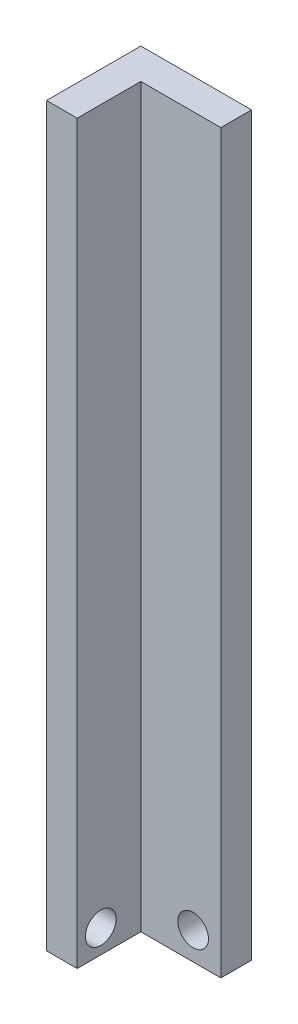
ISO-10303-21;
HEADER;
FILE_DESCRIPTION(('STEP AP214'),'2;1');
FILE_NAME('part.step','',(''),(''),'','','');
FILE_SCHEMA(('AUTOMOTIVE_DESIGN { 1 0 10303 214 1 1 1 1 }'));
ENDSEC;
DATA;
#1=APPLICATION_CONTEXT('core data for automotive mechanical design processes');
#2=APPLICATION_PROTOCOL_DEFINITION('international standard','automotive_design',2000,#1);
#3=PRODUCT_CONTEXT('',#1,'mechanical');
#4=PRODUCT('Part','Part','',(#3));
#5=PRODUCT_RELATED_PRODUCT_CATEGORY('part','',(#4));
#6=PRODUCT_DEFINITION_FORMATION('','',#4);
#7=PRODUCT_DEFINITION_CONTEXT('part definition',#1,'design');
#8=PRODUCT_DEFINITION('design','',#6,#7);
#9=PRODUCT_DEFINITION_SHAPE('','',#8);
#10=(LENGTH_UNIT() NAMED_UNIT(*) SI_UNIT(.MILLI.,.METRE.));
#11=(NAMED_UNIT(*) PLANE_ANGLE_UNIT() SI_UNIT($,.RADIAN.));
#12=(NAMED_UNIT(*) SI_UNIT($,.STERADIAN.) SOLID_ANGLE_UNIT());
#13=UNCERTAINTY_MEASURE_WITH_UNIT(LENGTH_MEASURE(1.E-05),#10,'distance_accuracy_value','');
#14=(GEOMETRIC_REPRESENTATION_CONTEXT(3) GLOBAL_UNCERTAINTY_ASSIGNED_CONTEXT((#13)) GLOBAL_UNIT_ASSIGNED_CONTEXT((#10,
#11,#12)) REPRESENTATION_CONTEXT('',''));
#15=CARTESIAN_POINT('',(0.,0.,0.));
#16=DIRECTION('',(0.,0.,1.));
#17=DIRECTION('',(1.,0.,0.));
#18=AXIS2_PLACEMENT_3D('',#15,#16,#17);
#19=CARTESIAN_POINT('',(-30.3425343753555,304.8,0.));
#20=DIRECTION('',(1.,0.,0.));
#21=DIRECTION('',(0.,0.,-1.));
#22=AXIS2_PLACEMENT_3D('',#19,#20,#21);
#23=PLANE('',#22);
#24=DIRECTION('',(0.,0.,1.));
#25=VECTOR('',#24,1.);
#26=CARTESIAN_POINT('',(-30.3425343753555,0.,0.));
#27=LINE('',#26,#25);
#28=CARTESIAN_POINT('',(-30.3425343753555,0.,-83.1160253016663));
#29=VERTEX_POINT('',#28);
#30=CARTESIAN_POINT('',(-30.3425343753555,0.,-70.4160253016663));
#31=VERTEX_POINT('',#30);
#32=EDGE_CURVE('E127',#29,#31,#27,.T.);
#33=ORIENTED_EDGE('',*,*,#32,.F.);
#34=DIRECTION('',(0.,-1.,0.));
#35=VECTOR('',#34,1.);
#36=CARTESIAN_POINT('',(-30.3425343753555,304.8,-83.1160253016663));
#37=LINE('',#36,#35);
#38=CARTESIAN_POINT('',(-30.3425343753555,304.8,-83.1160253016663));
#39=VERTEX_POINT('',#38);
#40=EDGE_CURVE('E13',#39,#29,#37,.T.);
#41=ORIENTED_EDGE('',*,*,#40,.F.);
#42=DIRECTION('',(0.,0.,1.));
#43=VECTOR('',#42,1.);
#44=CARTESIAN_POINT('',(-30.3425343753555,304.8,0.));
#45=LINE('',#44,#43);
#46=CARTESIAN_POINT('',(-30.3425343753555,304.8,-70.4160253016663));
#47=VERTEX_POINT('',#46);
#48=EDGE_CURVE('E139',#39,#47,#45,.T.);
#49=ORIENTED_EDGE('',*,*,#48,.T.);
#50=DIRECTION('',(0.,-1.,0.));
#51=VECTOR('',#50,1.);
#52=CARTESIAN_POINT('',(-30.3425343753555,304.8,-70.4160253016663));
#53=LINE('',#52,#51);
#54=EDGE_CURVE('E91',#47,#31,#53,.T.);
#55=ORIENTED_EDGE('',*,*,#54,.T.);
#56=EDGE_LOOP('',(#33,#41,#49,#55));
#57=FACE_BOUND('',#56,.T.);
#58=ADVANCED_FACE('F46',(#57),#23,.T.);
#59=CARTESIAN_POINT('',(0.,304.8,-83.1160253016663));
#60=DIRECTION('',(0.,0.,1.));
#61=DIRECTION('',(1.,0.,0.));
#62=AXIS2_PLACEMENT_3D('',#59,#60,#61);
#63=PLANE('',#62);
#64=CARTESIAN_POINT('',(-41.7927710231797,11.4502366478242,-83.1160253016663));
#65=DIRECTION('',(0.,0.,-1.));
#66=DIRECTION('',(-1.,0.,0.));
#67=AXIS2_PLACEMENT_3D('',#64,#65,#66);
#68=CIRCLE('',#67,6.35);
#69=CARTESIAN_POINT('',(-48.1427710231797,11.4502366478242,-83.1160253016663));
#70=VERTEX_POINT('',#69);
#71=EDGE_CURVE('E160',#70,#70,#68,.T.);
#72=ORIENTED_EDGE('',*,*,#71,.F.);
#73=EDGE_LOOP('',(#72));
#74=FACE_BOUND('',#73,.T.);
#75=DIRECTION('',(-1.,0.,0.));
#76=VECTOR('',#75,1.);
#77=CARTESIAN_POINT('',(0.,0.,-83.1160253016663));
#78=LINE('',#77,#76);
#79=CARTESIAN_POINT('',(-76.1434809666524,0.,-83.1160253016663));
#80=VERTEX_POINT('',#79);
#81=EDGE_CURVE('E130',#29,#80,#78,.T.);
#82=ORIENTED_EDGE('',*,*,#81,.T.);
#83=DIRECTION('',(0.,-1.,0.));
#84=VECTOR('',#83,1.);
#85=CARTESIAN_POINT('',(-76.1434809666524,304.8,-83.1160253016663));
#86=LINE('',#85,#84);
#87=CARTESIAN_POINT('',(-76.1434809666524,304.8,-83.1160253016663));
#88=VERTEX_POINT('',#87);
#89=EDGE_CURVE('E54',#88,#80,#86,.T.);
#90=ORIENTED_EDGE('',*,*,#89,.F.);
#91=DIRECTION('',(-1.,0.,0.));
#92=VECTOR('',#91,1.);
#93=CARTESIAN_POINT('',(0.,304.8,-83.1160253016663));
#94=LINE('',#93,#92);
#95=EDGE_CURVE('E154',#39,#88,#94,.T.);
#96=ORIENTED_EDGE('',*,*,#95,.F.);
#97=ORIENTED_EDGE('',*,*,#40,.T.);
#98=EDGE_LOOP('',(#82,#90,#96,#97));
#99=FACE_BOUND('',#98,.T.);
#100=ADVANCED_FACE('F173',(#74,#99),#63,.F.);
#101=CARTESIAN_POINT('',(-76.1434809666524,304.8,0.));
#102=DIRECTION('',(1.,0.,0.));
#103=DIRECTION('',(0.,0.,-1.));
#104=AXIS2_PLACEMENT_3D('',#101,#102,#103);
#105=PLANE('',#104);
#106=CARTESIAN_POINT('',(-76.1434809666524,9.75831477105418,-53.8410809885038));
#107=DIRECTION('',(-1.,0.,0.));
#108=DIRECTION('',(0.,0.,1.));
#109=AXIS2_PLACEMENT_3D('',#106,#107,#108);
#110=CIRCLE('',#109,6.35);
#111=CARTESIAN_POINT('',(-76.1434809666524,9.75831477105418,-47.4910809885038));
#112=VERTEX_POINT('',#111);
#113=EDGE_CURVE('E166',#112,#112,#110,.T.);
#114=ORIENTED_EDGE('',*,*,#113,.F.);
#115=EDGE_LOOP('',(#114));
#116=FACE_BOUND('',#115,.T.);
#117=DIRECTION('',(0.,0.,1.));
#118=VECTOR('',#117,1.);
#119=CARTESIAN_POINT('',(-76.1434809666524,0.,0.));
#120=LINE('',#119,#118);
#121=CARTESIAN_POINT('',(-76.1434809666524,0.,-44.0827662174496));
#122=VERTEX_POINT('',#121);
#123=EDGE_CURVE('E133',#80,#122,#120,.T.);
#124=ORIENTED_EDGE('',*,*,#123,.T.);
#125=DIRECTION('',(0.,-1.,0.));
#126=VECTOR('',#125,1.);
#127=CARTESIAN_POINT('',(-76.1434809666524,304.8,-44.0827662174496));
#128=LINE('',#127,#126);
#129=CARTESIAN_POINT('',(-76.1434809666524,304.8,-44.0827662174496));
#130=VERTEX_POINT('',#129);
#131=EDGE_CURVE('E119',#130,#122,#128,.T.);
#132=ORIENTED_EDGE('',*,*,#131,.F.);
#133=DIRECTION('',(0.,0.,1.));
#134=VECTOR('',#133,1.);
#135=CARTESIAN_POINT('',(-76.1434809666524,304.8,0.));
#136=LINE('',#135,#134);
#137=EDGE_CURVE('E110',#88,#130,#136,.T.);
#138=ORIENTED_EDGE('',*,*,#137,.F.);
#139=ORIENTED_EDGE('',*,*,#89,.T.);
#140=EDGE_LOOP('',(#124,#132,#138,#139));
#141=FACE_BOUND('',#140,.T.);
#142=ADVANCED_FACE('F146',(#116,#141),#105,.F.);
#143=CARTESIAN_POINT('',(0.,304.8,-44.0827662174496));
#144=DIRECTION('',(0.,0.,-1.));
#145=DIRECTION('',(-1.,0.,0.));
#146=AXIS2_PLACEMENT_3D('',#143,#144,#145);
#147=PLANE('',#146);
#148=DIRECTION('',(1.,0.,0.));
#149=VECTOR('',#148,1.);
#150=CARTESIAN_POINT('',(0.,0.,-44.0827662174496));
#151=LINE('',#150,#149);
#152=CARTESIAN_POINT('',(-63.4434809666524,0.,-44.0827662174496));
#153=VERTEX_POINT('',#152);
#154=EDGE_CURVE('E118',#122,#153,#151,.T.);
#155=ORIENTED_EDGE('',*,*,#154,.T.);
#156=DIRECTION('',(0.,-1.,0.));
#157=VECTOR('',#156,1.);
#158=CARTESIAN_POINT('',(-63.4434809666524,304.8,-44.0827662174496));
#159=LINE('',#158,#157);
#160=CARTESIAN_POINT('',(-63.4434809666524,304.8,-44.0827662174496));
#161=VERTEX_POINT('',#160);
#162=EDGE_CURVE('E115',#161,#153,#159,.T.);
#163=ORIENTED_EDGE('',*,*,#162,.F.);
#164=DIRECTION('',(1.,0.,0.));
#165=VECTOR('',#164,1.);
#166=CARTESIAN_POINT('',(0.,304.8,-44.0827662174496));
#167=LINE('',#166,#165);
#168=EDGE_CURVE('E104',#130,#161,#167,.T.);
#169=ORIENTED_EDGE('',*,*,#168,.F.);
#170=ORIENTED_EDGE('',*,*,#131,.T.);
#171=EDGE_LOOP('',(#155,#163,#169,#170));
#172=FACE_BOUND('',#171,.T.);
#173=ADVANCED_FACE('F116',(#172),#147,.F.);
#174=CARTESIAN_POINT('',(-63.4434809666524,304.8,0.));
#175=DIRECTION('',(-1.,0.,0.));
#176=DIRECTION('',(0.,0.,1.));
#177=AXIS2_PLACEMENT_3D('',#174,#175,#176);
#178=PLANE('',#177);
#179=CARTESIAN_POINT('',(-63.4434809666524,9.75831477105418,-53.8410809885038));
#180=DIRECTION('',(-1.,0.,0.));
#181=DIRECTION('',(0.,0.,1.));
#182=AXIS2_PLACEMENT_3D('',#179,#180,#181);
#183=CIRCLE('',#182,6.35);
#184=CARTESIAN_POINT('',(-63.4434809666524,9.75831477105418,-47.4910809885038));
#185=VERTEX_POINT('',#184);
#186=EDGE_CURVE('E163',#185,#185,#183,.F.);
#187=ORIENTED_EDGE('',*,*,#186,.F.);
#188=EDGE_LOOP('',(#187));
#189=FACE_BOUND('',#188,.T.);
#190=DIRECTION('',(0.,0.,-1.));
#191=VECTOR('',#190,1.);
#192=CARTESIAN_POINT('',(-63.4434809666524,0.,0.));
#193=LINE('',#192,#191);
#194=CARTESIAN_POINT('',(-63.4434809666524,0.,-70.4160253016663));
#195=VERTEX_POINT('',#194);
#196=EDGE_CURVE('E84',#153,#195,#193,.T.);
#197=ORIENTED_EDGE('',*,*,#196,.T.);
#198=DIRECTION('',(0.,-1.,0.));
#199=VECTOR('',#198,1.);
#200=CARTESIAN_POINT('',(-63.4434809666524,304.8,-70.4160253016663));
#201=LINE('',#200,#199);
#202=CARTESIAN_POINT('',(-63.4434809666524,304.8,-70.4160253016663));
#203=VERTEX_POINT('',#202);
#204=EDGE_CURVE('E120',#203,#195,#201,.T.);
#205=ORIENTED_EDGE('',*,*,#204,.F.);
#206=DIRECTION('',(0.,0.,-1.));
#207=VECTOR('',#206,1.);
#208=CARTESIAN_POINT('',(-63.4434809666524,304.8,0.));
#209=LINE('',#208,#207);
#210=EDGE_CURVE('E108',#161,#203,#209,.T.);
#211=ORIENTED_EDGE('',*,*,#210,.F.);
#212=ORIENTED_EDGE('',*,*,#162,.T.);
#213=EDGE_LOOP('',(#197,#205,#211,#212));
#214=FACE_BOUND('',#213,.T.);
#215=ADVANCED_FACE('F122',(#189,#214),#178,.F.);
#216=CARTESIAN_POINT('',(0.,304.8,-70.4160253016663));
#217=DIRECTION('',(0.,0.,-1.));
#218=DIRECTION('',(-1.,0.,0.));
#219=AXIS2_PLACEMENT_3D('',#216,#217,#218);
#220=PLANE('',#219);
#221=CARTESIAN_POINT('',(-41.7927710231797,11.4502366478242,-70.4160253016663));
#222=DIRECTION('',(0.,0.,-1.));
#223=DIRECTION('',(-1.,0.,0.));
#224=AXIS2_PLACEMENT_3D('',#221,#222,#223);
#225=CIRCLE('',#224,6.35);
#226=CARTESIAN_POINT('',(-48.1427710231797,11.4502366478242,-70.4160253016663));
#227=VERTEX_POINT('',#226);
#228=EDGE_CURVE('E131',#227,#227,#225,.F.);
#229=ORIENTED_EDGE('',*,*,#228,.F.);
#230=EDGE_LOOP('',(#229));
#231=FACE_BOUND('',#230,.T.);
#232=DIRECTION('',(1.,0.,0.));
#233=VECTOR('',#232,1.);
#234=CARTESIAN_POINT('',(0.,0.,-70.4160253016663));
#235=LINE('',#234,#233);
#236=EDGE_CURVE('E137',#195,#31,#235,.T.);
#237=ORIENTED_EDGE('',*,*,#236,.T.);
#238=ORIENTED_EDGE('',*,*,#54,.F.);
#239=DIRECTION('',(1.,0.,0.));
#240=VECTOR('',#239,1.);
#241=CARTESIAN_POINT('',(0.,304.8,-70.4160253016663));
#242=LINE('',#241,#240);
#243=EDGE_CURVE('E62',#203,#47,#242,.T.);
#244=ORIENTED_EDGE('',*,*,#243,.F.);
#245=ORIENTED_EDGE('',*,*,#204,.T.);
#246=EDGE_LOOP('',(#237,#238,#244,#245));
#247=FACE_BOUND('',#246,.T.);
#248=ADVANCED_FACE('F153',(#231,#247),#220,.F.);
#249=CARTESIAN_POINT('',(0.,304.8,0.));
#250=DIRECTION('',(0.,1.,0.));
#251=DIRECTION('',(0.,0.,1.));
#252=AXIS2_PLACEMENT_3D('',#249,#250,#251);
#253=PLANE('',#252);
#254=ORIENTED_EDGE('',*,*,#48,.F.);
#255=ORIENTED_EDGE('',*,*,#95,.T.);
#256=ORIENTED_EDGE('',*,*,#137,.T.);
#257=ORIENTED_EDGE('',*,*,#168,.T.);
#258=ORIENTED_EDGE('',*,*,#210,.T.);
#259=ORIENTED_EDGE('',*,*,#243,.T.);
#260=EDGE_LOOP('',(#254,#255,#256,#257,#258,#259));
#261=FACE_BOUND('',#260,.T.);
#262=ADVANCED_FACE('F106',(#261),#253,.T.);
#263=CARTESIAN_POINT('',(0.,0.,0.));
#264=DIRECTION('',(0.,1.,0.));
#265=DIRECTION('',(0.,0.,1.));
#266=AXIS2_PLACEMENT_3D('',#263,#264,#265);
#267=PLANE('',#266);
#268=ORIENTED_EDGE('',*,*,#32,.T.);
#269=ORIENTED_EDGE('',*,*,#236,.F.);
#270=ORIENTED_EDGE('',*,*,#196,.F.);
#271=ORIENTED_EDGE('',*,*,#154,.F.);
#272=ORIENTED_EDGE('',*,*,#123,.F.);
#273=ORIENTED_EDGE('',*,*,#81,.F.);
#274=EDGE_LOOP('',(#268,#269,#270,#271,#272,#273));
#275=FACE_BOUND('',#274,.T.);
#276=ADVANCED_FACE('F150',(#275),#267,.F.);
#277=CARTESIAN_POINT('',(-41.7927710231797,11.4502366478242,-52.455513059528));
#278=DIRECTION('',(0.,0.,-1.));
#279=DIRECTION('',(-1.,0.,0.));
#280=AXIS2_PLACEMENT_3D('',#277,#278,#279);
#281=CYLINDRICAL_SURFACE('',#280,6.35);
#282=ORIENTED_EDGE('',*,*,#228,.T.);
#283=EDGE_LOOP('',(#282));
#284=FACE_BOUND('',#283,.T.);
#285=ORIENTED_EDGE('',*,*,#71,.T.);
#286=EDGE_LOOP('',(#285));
#287=FACE_BOUND('',#286,.T.);
#288=ADVANCED_FACE('F213',(#284,#287),#281,.F.);
#289=CARTESIAN_POINT('',(-45.4829687245141,9.75831477105418,-53.8410809885038));
#290=DIRECTION('',(-1.,0.,0.));
#291=DIRECTION('',(0.,0.,1.));
#292=AXIS2_PLACEMENT_3D('',#289,#290,#291);
#293=CYLINDRICAL_SURFACE('',#292,6.35);
#294=ORIENTED_EDGE('',*,*,#186,.T.);
#295=EDGE_LOOP('',(#294));
#296=FACE_BOUND('',#295,.T.);
#297=ORIENTED_EDGE('',*,*,#113,.T.);
#298=EDGE_LOOP('',(#297));
#299=FACE_BOUND('',#298,.T.);
#300=ADVANCED_FACE('F170',(#296,#299),#293,.F.);
#301=CLOSED_SHELL('',(#58,#100,#142,#173,#215,#248,#262,#276,#288,#300));
#302=MANIFOLD_SOLID_BREP('B2',#301);
#303=ADVANCED_BREP_SHAPE_REPRESENTATION('',(#18,#302),#14);
#304=SHAPE_DEFINITION_REPRESENTATION(#9,#303);
ENDSEC;
END-ISO-10303-21;
